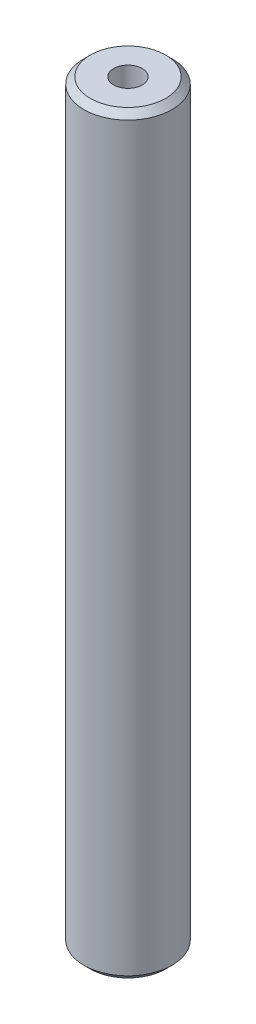
ISO-10303-21;
HEADER;
FILE_DESCRIPTION(('STEP AP214'),'2;1');
FILE_NAME('part.step','',(''),(''),'','','');
FILE_SCHEMA(('AUTOMOTIVE_DESIGN { 1 0 10303 214 1 1 1 1 }'));
ENDSEC;
DATA;
#1=APPLICATION_CONTEXT('core data for automotive mechanical design processes');
#2=APPLICATION_PROTOCOL_DEFINITION('international standard','automotive_design',2000,#1);
#3=PRODUCT_CONTEXT('',#1,'mechanical');
#4=PRODUCT('Part','Part','',(#3));
#5=PRODUCT_RELATED_PRODUCT_CATEGORY('part','',(#4));
#6=PRODUCT_DEFINITION_FORMATION('','',#4);
#7=PRODUCT_DEFINITION_CONTEXT('part definition',#1,'design');
#8=PRODUCT_DEFINITION('design','',#6,#7);
#9=PRODUCT_DEFINITION_SHAPE('','',#8);
#10=(LENGTH_UNIT() NAMED_UNIT(*) SI_UNIT(.MILLI.,.METRE.));
#11=(NAMED_UNIT(*) PLANE_ANGLE_UNIT() SI_UNIT($,.RADIAN.));
#12=(NAMED_UNIT(*) SI_UNIT($,.STERADIAN.) SOLID_ANGLE_UNIT());
#13=UNCERTAINTY_MEASURE_WITH_UNIT(LENGTH_MEASURE(1.E-05),#10,'distance_accuracy_value','');
#14=(GEOMETRIC_REPRESENTATION_CONTEXT(3) GLOBAL_UNCERTAINTY_ASSIGNED_CONTEXT((#13)) GLOBAL_UNIT_ASSIGNED_CONTEXT((#10,
#11,#12)) REPRESENTATION_CONTEXT('',''));
#15=CARTESIAN_POINT('',(0.,0.,0.));
#16=DIRECTION('',(0.,0.,1.));
#17=DIRECTION('',(1.,0.,0.));
#18=AXIS2_PLACEMENT_3D('',#15,#16,#17);
#19=CARTESIAN_POINT('',(0.,128.302054555871,0.));
#20=DIRECTION('',(0.,-1.,0.));
#21=DIRECTION('',(0.,0.,-1.));
#22=AXIS2_PLACEMENT_3D('',#19,#20,#21);
#23=CYLINDRICAL_SURFACE('',#22,7.5);
#24=CARTESIAN_POINT('',(0.,127.206934687846,0.));
#25=DIRECTION('',(0.,1.,0.));
#26=DIRECTION('',(0.,0.,1.));
#27=AXIS2_PLACEMENT_3D('',#24,#25,#26);
#28=CIRCLE('',#27,7.5);
#29=CARTESIAN_POINT('',(0.,127.206934687846,7.5));
#30=VERTEX_POINT('',#29);
#31=EDGE_CURVE('E50',#30,#30,#28,.F.);
#32=ORIENTED_EDGE('',*,*,#31,.T.);
#33=EDGE_LOOP('',(#32));
#34=FACE_BOUND('',#33,.T.);
#35=CARTESIAN_POINT('',(0.,1.0951198680246,0.));
#36=DIRECTION('',(0.,1.,0.));
#37=DIRECTION('',(0.,0.,1.));
#38=AXIS2_PLACEMENT_3D('',#35,#36,#37);
#39=CIRCLE('',#38,7.5);
#40=CARTESIAN_POINT('',(0.,1.0951198680246,7.5));
#41=VERTEX_POINT('',#40);
#42=EDGE_CURVE('E51',#41,#41,#39,.T.);
#43=ORIENTED_EDGE('',*,*,#42,.T.);
#44=EDGE_LOOP('',(#43));
#45=FACE_BOUND('',#44,.T.);
#46=ADVANCED_FACE('F39',(#34,#45),#23,.T.);
#47=CARTESIAN_POINT('',(0.,128.302054555871,0.));
#48=DIRECTION('',(0.,1.,0.));
#49=DIRECTION('',(0.,0.,1.));
#50=AXIS2_PLACEMENT_3D('',#47,#48,#49);
#51=PLANE('',#50);
#52=CARTESIAN_POINT('',(0.,128.302054555871,0.));
#53=DIRECTION('',(0.,1.,0.));
#54=DIRECTION('',(0.,0.,1.));
#55=AXIS2_PLACEMENT_3D('',#52,#53,#54);
#56=CIRCLE('',#55,6.40488013197539);
#57=CARTESIAN_POINT('',(0.,128.302054555871,6.40488013197539));
#58=VERTEX_POINT('',#57);
#59=EDGE_CURVE('E54',#58,#58,#56,.T.);
#60=ORIENTED_EDGE('',*,*,#59,.T.);
#61=EDGE_LOOP('',(#60));
#62=FACE_BOUND('',#61,.T.);
#63=CARTESIAN_POINT('',(0.,128.302054555871,0.));
#64=DIRECTION('',(0.,1.,0.));
#65=DIRECTION('',(0.,0.,1.));
#66=AXIS2_PLACEMENT_3D('',#63,#64,#65);
#67=CIRCLE('',#66,2.4333782730509);
#68=CARTESIAN_POINT('',(0.,128.302054555871,2.4333782730509));
#69=VERTEX_POINT('',#68);
#70=EDGE_CURVE('E58',#69,#69,#67,.T.);
#71=ORIENTED_EDGE('',*,*,#70,.F.);
#72=EDGE_LOOP('',(#71));
#73=FACE_BOUND('',#72,.T.);
#74=ADVANCED_FACE('F69',(#62,#73),#51,.T.);
#75=CARTESIAN_POINT('',(0.,0.,0.));
#76=DIRECTION('',(0.,1.,0.));
#77=DIRECTION('',(0.,0.,1.));
#78=AXIS2_PLACEMENT_3D('',#75,#76,#77);
#79=PLANE('',#78);
#80=CARTESIAN_POINT('',(0.,0.,0.));
#81=DIRECTION('',(0.,1.,0.));
#82=DIRECTION('',(0.,0.,1.));
#83=AXIS2_PLACEMENT_3D('',#80,#81,#82);
#84=CIRCLE('',#83,6.40488013197539);
#85=CARTESIAN_POINT('',(0.,0.,6.40488013197539));
#86=VERTEX_POINT('',#85);
#87=EDGE_CURVE('E10',#86,#86,#84,.F.);
#88=ORIENTED_EDGE('',*,*,#87,.T.);
#89=EDGE_LOOP('',(#88));
#90=FACE_BOUND('',#89,.T.);
#91=CARTESIAN_POINT('',(0.,0.,0.));
#92=DIRECTION('',(0.,1.,0.));
#93=DIRECTION('',(0.,0.,1.));
#94=AXIS2_PLACEMENT_3D('',#91,#92,#93);
#95=CIRCLE('',#94,2.4333782730509);
#96=CARTESIAN_POINT('',(0.,0.,2.4333782730509));
#97=VERTEX_POINT('',#96);
#98=EDGE_CURVE('E63',#97,#97,#95,.T.);
#99=ORIENTED_EDGE('',*,*,#98,.T.);
#100=EDGE_LOOP('',(#99));
#101=FACE_BOUND('',#100,.T.);
#102=ADVANCED_FACE('F75',(#90,#101),#79,.F.);
#103=CARTESIAN_POINT('',(0.,128.302054555871,0.));
#104=DIRECTION('',(0.,-1.,0.));
#105=DIRECTION('',(0.,0.,-1.));
#106=AXIS2_PLACEMENT_3D('',#103,#104,#105);
#107=CYLINDRICAL_SURFACE('',#106,2.4333782730509);
#108=ORIENTED_EDGE('',*,*,#70,.T.);
#109=EDGE_LOOP('',(#108));
#110=FACE_BOUND('',#109,.T.);
#111=ORIENTED_EDGE('',*,*,#98,.F.);
#112=EDGE_LOOP('',(#111));
#113=FACE_BOUND('',#112,.T.);
#114=ADVANCED_FACE('F70',(#110,#113),#107,.F.);
#115=CARTESIAN_POINT('',(0.,128.302054555871,0.));
#116=DIRECTION('',(0.,-1.,0.));
#117=DIRECTION('',(0.,0.,-1.));
#118=AXIS2_PLACEMENT_3D('',#115,#116,#117);
#119=CONICAL_SURFACE('',#118,6.40488013197539,0.785398163397451);
#120=ORIENTED_EDGE('',*,*,#31,.F.);
#121=EDGE_LOOP('',(#120));
#122=FACE_BOUND('',#121,.T.);
#123=ORIENTED_EDGE('',*,*,#59,.F.);
#124=EDGE_LOOP('',(#123));
#125=FACE_BOUND('',#124,.T.);
#126=ADVANCED_FACE('F81',(#122,#125),#119,.T.);
#127=CARTESIAN_POINT('',(0.,1.0951198680246,0.));
#128=DIRECTION('',(0.,1.,0.));
#129=DIRECTION('',(0.,0.,1.));
#130=AXIS2_PLACEMENT_3D('',#127,#128,#129);
#131=CONICAL_SURFACE('',#130,7.5,0.785398163397451);
#132=ORIENTED_EDGE('',*,*,#87,.F.);
#133=EDGE_LOOP('',(#132));
#134=FACE_BOUND('',#133,.T.);
#135=ORIENTED_EDGE('',*,*,#42,.F.);
#136=EDGE_LOOP('',(#135));
#137=FACE_BOUND('',#136,.T.);
#138=ADVANCED_FACE('F45',(#134,#137),#131,.T.);
#139=CLOSED_SHELL('',(#46,#74,#102,#114,#126,#138));
#140=MANIFOLD_SOLID_BREP('B2',#139);
#141=ADVANCED_BREP_SHAPE_REPRESENTATION('',(#18,#140),#14);
#142=SHAPE_DEFINITION_REPRESENTATION(#9,#141);
ENDSEC;
END-ISO-10303-21;
